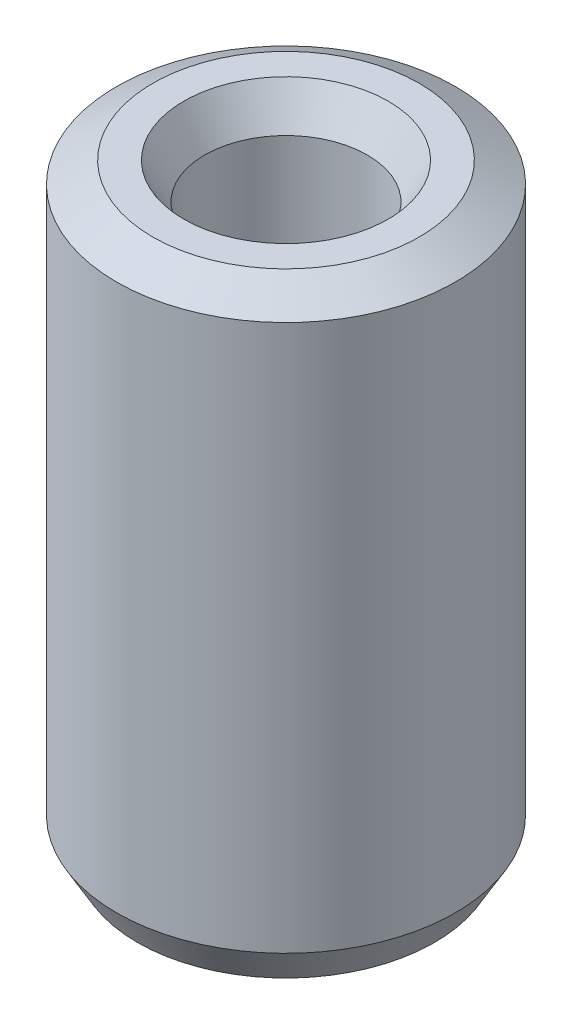
ISO-10303-21;
HEADER;
FILE_DESCRIPTION(('STEP AP214'),'2;1');
FILE_NAME('part.step','',(''),(''),'','','');
FILE_SCHEMA(('AUTOMOTIVE_DESIGN { 1 0 10303 214 1 1 1 1 }'));
ENDSEC;
DATA;
#1=APPLICATION_CONTEXT('core data for automotive mechanical design processes');
#2=APPLICATION_PROTOCOL_DEFINITION('international standard','automotive_design',2000,#1);
#3=PRODUCT_CONTEXT('',#1,'mechanical');
#4=PRODUCT('Part','Part','',(#3));
#5=PRODUCT_RELATED_PRODUCT_CATEGORY('part','',(#4));
#6=PRODUCT_DEFINITION_FORMATION('','',#4);
#7=PRODUCT_DEFINITION_CONTEXT('part definition',#1,'design');
#8=PRODUCT_DEFINITION('design','',#6,#7);
#9=PRODUCT_DEFINITION_SHAPE('','',#8);
#10=(LENGTH_UNIT() NAMED_UNIT(*) SI_UNIT(.MILLI.,.METRE.));
#11=(NAMED_UNIT(*) PLANE_ANGLE_UNIT() SI_UNIT($,.RADIAN.));
#12=(NAMED_UNIT(*) SI_UNIT($,.STERADIAN.) SOLID_ANGLE_UNIT());
#13=UNCERTAINTY_MEASURE_WITH_UNIT(LENGTH_MEASURE(1.E-05),#10,'distance_accuracy_value','');
#14=(GEOMETRIC_REPRESENTATION_CONTEXT(3) GLOBAL_UNCERTAINTY_ASSIGNED_CONTEXT((#13)) GLOBAL_UNIT_ASSIGNED_CONTEXT((#10,
#11,#12)) REPRESENTATION_CONTEXT('',''));
#15=CARTESIAN_POINT('',(0.,0.,0.));
#16=DIRECTION('',(0.,0.,1.));
#17=DIRECTION('',(1.,0.,0.));
#18=AXIS2_PLACEMENT_3D('',#15,#16,#17);
#19=CARTESIAN_POINT('',(0.,106.85535626588,0.));
#20=DIRECTION('',(0.,-1.,0.));
#21=DIRECTION('',(0.,0.,-1.));
#22=AXIS2_PLACEMENT_3D('',#19,#20,#21);
#23=CYLINDRICAL_SURFACE('',#22,30.);
#24=CARTESIAN_POINT('',(0.,6.40723359378702,0.));
#25=DIRECTION('',(0.,1.,0.));
#26=DIRECTION('',(0.,0.,1.));
#27=AXIS2_PLACEMENT_3D('',#24,#25,#26);
#28=CIRCLE('',#27,30.);
#29=CARTESIAN_POINT('',(0.,6.40723359378702,30.));
#30=VERTEX_POINT('',#29);
#31=EDGE_CURVE('E10',#30,#30,#28,.T.);
#32=ORIENTED_EDGE('',*,*,#31,.T.);
#33=EDGE_LOOP('',(#32));
#34=FACE_BOUND('',#33,.T.);
#35=CARTESIAN_POINT('',(0.,103.156138225746,0.));
#36=DIRECTION('',(0.,1.,0.));
#37=DIRECTION('',(0.,0.,1.));
#38=AXIS2_PLACEMENT_3D('',#35,#36,#37);
#39=CIRCLE('',#38,30.);
#40=CARTESIAN_POINT('',(0.,103.156138225746,30.));
#41=VERTEX_POINT('',#40);
#42=EDGE_CURVE('E50',#41,#41,#39,.F.);
#43=ORIENTED_EDGE('',*,*,#42,.T.);
#44=EDGE_LOOP('',(#43));
#45=FACE_BOUND('',#44,.T.);
#46=ADVANCED_FACE('F39',(#34,#45),#23,.T.);
#47=CARTESIAN_POINT('',(0.,106.85535626588,0.));
#48=DIRECTION('',(0.,1.,0.));
#49=DIRECTION('',(0.,0.,1.));
#50=AXIS2_PLACEMENT_3D('',#47,#48,#49);
#51=PLANE('',#50);
#52=CARTESIAN_POINT('',(0.,106.85535626588,0.));
#53=DIRECTION('',(0.,1.,0.));
#54=DIRECTION('',(0.,0.,1.));
#55=AXIS2_PLACEMENT_3D('',#52,#53,#54);
#56=CIRCLE('',#55,18.1062036567439);
#57=CARTESIAN_POINT('',(0.,106.85535626588,18.1062036567439));
#58=VERTEX_POINT('',#57);
#59=EDGE_CURVE('E58',#58,#58,#56,.F.);
#60=ORIENTED_EDGE('',*,*,#59,.T.);
#61=EDGE_LOOP('',(#60));
#62=FACE_BOUND('',#61,.T.);
#63=CARTESIAN_POINT('',(0.,106.85535626588,0.));
#64=DIRECTION('',(0.,1.,0.));
#65=DIRECTION('',(0.,0.,1.));
#66=AXIS2_PLACEMENT_3D('',#63,#64,#65);
#67=CIRCLE('',#66,23.592766406213);
#68=CARTESIAN_POINT('',(0.,106.85535626588,23.592766406213));
#69=VERTEX_POINT('',#68);
#70=EDGE_CURVE('E61',#69,#69,#67,.T.);
#71=ORIENTED_EDGE('',*,*,#70,.T.);
#72=EDGE_LOOP('',(#71));
#73=FACE_BOUND('',#72,.T.);
#74=ADVANCED_FACE('F88',(#62,#73),#51,.T.);
#75=CARTESIAN_POINT('',(0.,0.,0.));
#76=DIRECTION('',(0.,1.,0.));
#77=DIRECTION('',(0.,0.,1.));
#78=AXIS2_PLACEMENT_3D('',#75,#76,#77);
#79=PLANE('',#78);
#80=CARTESIAN_POINT('',(0.,0.,0.));
#81=DIRECTION('',(0.,1.,0.));
#82=DIRECTION('',(0.,0.,1.));
#83=AXIS2_PLACEMENT_3D('',#80,#81,#82);
#84=CIRCLE('',#83,20.8142192103971);
#85=CARTESIAN_POINT('',(0.,0.,20.8142192103971));
#86=VERTEX_POINT('',#85);
#87=EDGE_CURVE('E51',#86,#86,#84,.T.);
#88=ORIENTED_EDGE('',*,*,#87,.T.);
#89=EDGE_LOOP('',(#88));
#90=FACE_BOUND('',#89,.T.);
#91=CARTESIAN_POINT('',(0.,0.,0.));
#92=DIRECTION('',(0.,1.,0.));
#93=DIRECTION('',(0.,0.,1.));
#94=AXIS2_PLACEMENT_3D('',#91,#92,#93);
#95=CIRCLE('',#94,26.3007819598662);
#96=CARTESIAN_POINT('',(0.,0.,26.3007819598662));
#97=VERTEX_POINT('',#96);
#98=EDGE_CURVE('E54',#97,#97,#95,.F.);
#99=ORIENTED_EDGE('',*,*,#98,.T.);
#100=EDGE_LOOP('',(#99));
#101=FACE_BOUND('',#100,.T.);
#102=ADVANCED_FACE('F83',(#90,#101),#79,.F.);
#103=CARTESIAN_POINT('',(0.,106.85535626588,0.));
#104=DIRECTION('',(0.,-1.,0.));
#105=DIRECTION('',(0.,0.,-1.));
#106=AXIS2_PLACEMENT_3D('',#103,#104,#105);
#107=CYLINDRICAL_SURFACE('',#106,14.4069856166101);
#108=CARTESIAN_POINT('',(0.,100.448122672093,0.));
#109=DIRECTION('',(0.,1.,0.));
#110=DIRECTION('',(0.,0.,1.));
#111=AXIS2_PLACEMENT_3D('',#108,#109,#110);
#112=CIRCLE('',#111,14.4069856166101);
#113=CARTESIAN_POINT('',(0.,100.448122672093,14.4069856166101));
#114=VERTEX_POINT('',#113);
#115=EDGE_CURVE('E67',#114,#114,#112,.T.);
#116=ORIENTED_EDGE('',*,*,#115,.T.);
#117=EDGE_LOOP('',(#116));
#118=FACE_BOUND('',#117,.T.);
#119=CARTESIAN_POINT('',(0.,3.69921804013378,0.));
#120=DIRECTION('',(0.,1.,0.));
#121=DIRECTION('',(0.,0.,1.));
#122=AXIS2_PLACEMENT_3D('',#119,#120,#121);
#123=CIRCLE('',#122,14.4069856166101);
#124=CARTESIAN_POINT('',(0.,3.69921804013378,14.4069856166101));
#125=VERTEX_POINT('',#124);
#126=EDGE_CURVE('E69',#125,#125,#123,.F.);
#127=ORIENTED_EDGE('',*,*,#126,.T.);
#128=EDGE_LOOP('',(#127));
#129=FACE_BOUND('',#128,.T.);
#130=ADVANCED_FACE('F71',(#118,#129),#107,.F.);
#131=CARTESIAN_POINT('',(0.,100.448122672093,0.));
#132=DIRECTION('',(0.,1.,0.));
#133=DIRECTION('',(0.,0.,1.));
#134=AXIS2_PLACEMENT_3D('',#131,#132,#133);
#135=CONICAL_SURFACE('',#134,14.4069856166101,0.523598775598302);
#136=ORIENTED_EDGE('',*,*,#59,.F.);
#137=EDGE_LOOP('',(#136));
#138=FACE_BOUND('',#137,.T.);
#139=ORIENTED_EDGE('',*,*,#115,.F.);
#140=EDGE_LOOP('',(#139));
#141=FACE_BOUND('',#140,.T.);
#142=ADVANCED_FACE('F77',(#138,#141),#135,.F.);
#143=CARTESIAN_POINT('',(0.,0.,0.));
#144=DIRECTION('',(0.,-1.,0.));
#145=DIRECTION('',(0.,0.,-1.));
#146=AXIS2_PLACEMENT_3D('',#143,#144,#145);
#147=CONICAL_SURFACE('',#146,20.8142192103971,1.04719755119659);
#148=ORIENTED_EDGE('',*,*,#126,.F.);
#149=EDGE_LOOP('',(#148));
#150=FACE_BOUND('',#149,.T.);
#151=ORIENTED_EDGE('',*,*,#87,.F.);
#152=EDGE_LOOP('',(#151));
#153=FACE_BOUND('',#152,.T.);
#154=ADVANCED_FACE('F73',(#150,#153),#147,.F.);
#155=CARTESIAN_POINT('',(0.,6.40723359378702,0.));
#156=DIRECTION('',(0.,1.,0.));
#157=DIRECTION('',(0.,0.,1.));
#158=AXIS2_PLACEMENT_3D('',#155,#156,#157);
#159=CONICAL_SURFACE('',#158,30.,0.523598775598303);
#160=ORIENTED_EDGE('',*,*,#98,.F.);
#161=EDGE_LOOP('',(#160));
#162=FACE_BOUND('',#161,.T.);
#163=ORIENTED_EDGE('',*,*,#31,.F.);
#164=EDGE_LOOP('',(#163));
#165=FACE_BOUND('',#164,.T.);
#166=ADVANCED_FACE('F76',(#162,#165),#159,.T.);
#167=CARTESIAN_POINT('',(0.,106.85535626588,0.));
#168=DIRECTION('',(0.,-1.,0.));
#169=DIRECTION('',(0.,0.,-1.));
#170=AXIS2_PLACEMENT_3D('',#167,#168,#169);
#171=CONICAL_SURFACE('',#170,23.592766406213,1.04719755119659);
#172=ORIENTED_EDGE('',*,*,#42,.F.);
#173=EDGE_LOOP('',(#172));
#174=FACE_BOUND('',#173,.T.);
#175=ORIENTED_EDGE('',*,*,#70,.F.);
#176=EDGE_LOOP('',(#175));
#177=FACE_BOUND('',#176,.T.);
#178=ADVANCED_FACE('F45',(#174,#177),#171,.T.);
#179=CLOSED_SHELL('',(#46,#74,#102,#130,#142,#154,#166,#178));
#180=MANIFOLD_SOLID_BREP('B2',#179);
#181=ADVANCED_BREP_SHAPE_REPRESENTATION('',(#18,#180),#14);
#182=SHAPE_DEFINITION_REPRESENTATION(#9,#181);
ENDSEC;
END-ISO-10303-21;
